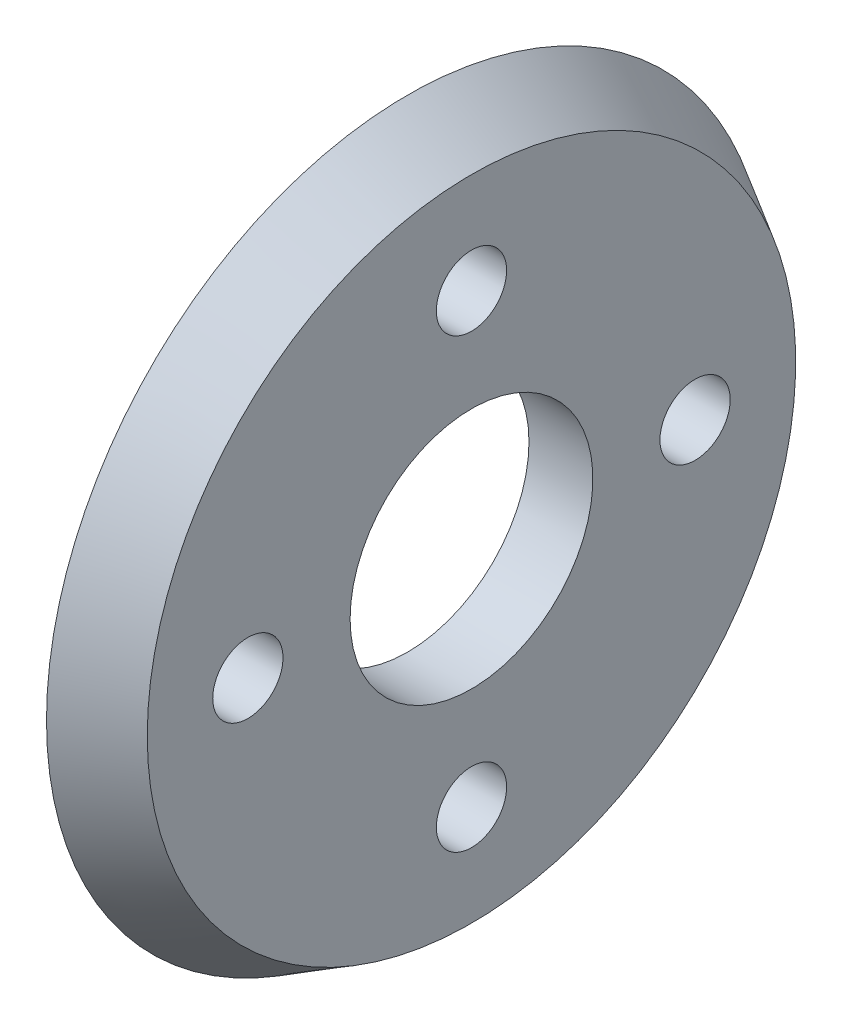
ISO-10303-21;
HEADER;
FILE_DESCRIPTION(('STEP AP214'),'2;1');
FILE_NAME('part.step','',(''),(''),'','','');
FILE_SCHEMA(('AUTOMOTIVE_DESIGN { 1 0 10303 214 1 1 1 1 }'));
ENDSEC;
DATA;
#1=APPLICATION_CONTEXT('core data for automotive mechanical design processes');
#2=APPLICATION_PROTOCOL_DEFINITION('international standard','automotive_design',2000,#1);
#3=PRODUCT_CONTEXT('',#1,'mechanical');
#4=PRODUCT('Part','Part','',(#3));
#5=PRODUCT_RELATED_PRODUCT_CATEGORY('part','',(#4));
#6=PRODUCT_DEFINITION_FORMATION('','',#4);
#7=PRODUCT_DEFINITION_CONTEXT('part definition',#1,'design');
#8=PRODUCT_DEFINITION('design','',#6,#7);
#9=PRODUCT_DEFINITION_SHAPE('','',#8);
#10=(LENGTH_UNIT() NAMED_UNIT(*) SI_UNIT(.MILLI.,.METRE.));
#11=(NAMED_UNIT(*) PLANE_ANGLE_UNIT() SI_UNIT($,.RADIAN.));
#12=(NAMED_UNIT(*) SI_UNIT($,.STERADIAN.) SOLID_ANGLE_UNIT());
#13=UNCERTAINTY_MEASURE_WITH_UNIT(LENGTH_MEASURE(1.E-05),#10,'distance_accuracy_value','');
#14=(GEOMETRIC_REPRESENTATION_CONTEXT(3) GLOBAL_UNCERTAINTY_ASSIGNED_CONTEXT((#13)) GLOBAL_UNIT_ASSIGNED_CONTEXT((#10,
#11,#12)) REPRESENTATION_CONTEXT('',''));
#15=CARTESIAN_POINT('',(0.,0.,0.));
#16=DIRECTION('',(0.,0.,1.));
#17=DIRECTION('',(1.,0.,0.));
#18=AXIS2_PLACEMENT_3D('',#15,#16,#17);
#19=CARTESIAN_POINT('',(-23.,0.,0.));
#20=DIRECTION('',(1.,0.,0.));
#21=DIRECTION('',(0.,0.,-1.));
#22=AXIS2_PLACEMENT_3D('',#19,#20,#21);
#23=PLANE('',#22);
#24=CARTESIAN_POINT('',(-23.,-7.,0.));
#25=DIRECTION('',(1.,0.,0.));
#26=DIRECTION('',(0.,0.,-1.));
#27=AXIS2_PLACEMENT_3D('',#24,#25,#26);
#28=CIRCLE('',#27,1.1);
#29=CARTESIAN_POINT('',(-23.,-7.,-1.1));
#30=VERTEX_POINT('',#29);
#31=EDGE_CURVE('E147',#30,#30,#28,.T.);
#32=ORIENTED_EDGE('',*,*,#31,.T.);
#33=EDGE_LOOP('',(#32));
#34=FACE_BOUND('',#33,.T.);
#35=CARTESIAN_POINT('',(-23.,0.,0.));
#36=DIRECTION('',(1.,0.,0.));
#37=DIRECTION('',(0.,0.,-1.));
#38=AXIS2_PLACEMENT_3D('',#35,#36,#37);
#39=CIRCLE('',#38,3.8);
#40=CARTESIAN_POINT('',(-23.,0.,-3.8));
#41=VERTEX_POINT('',#40);
#42=EDGE_CURVE('E145',#41,#41,#39,.T.);
#43=ORIENTED_EDGE('',*,*,#42,.T.);
#44=EDGE_LOOP('',(#43));
#45=FACE_BOUND('',#44,.T.);
#46=CARTESIAN_POINT('',(-23.,7.,0.));
#47=DIRECTION('',(1.,0.,0.));
#48=DIRECTION('',(0.,0.,-1.));
#49=AXIS2_PLACEMENT_3D('',#46,#47,#48);
#50=CIRCLE('',#49,1.1);
#51=CARTESIAN_POINT('',(-23.,7.,-1.1));
#52=VERTEX_POINT('',#51);
#53=EDGE_CURVE('E137',#52,#52,#50,.T.);
#54=ORIENTED_EDGE('',*,*,#53,.T.);
#55=EDGE_LOOP('',(#54));
#56=FACE_BOUND('',#55,.T.);
#57=CARTESIAN_POINT('',(-23.,0.,7.));
#58=DIRECTION('',(1.,0.,0.));
#59=DIRECTION('',(0.,0.,-1.));
#60=AXIS2_PLACEMENT_3D('',#57,#58,#59);
#61=CIRCLE('',#60,1.1);
#62=CARTESIAN_POINT('',(-23.,0.,5.9));
#63=VERTEX_POINT('',#62);
#64=EDGE_CURVE('E132',#63,#63,#61,.T.);
#65=ORIENTED_EDGE('',*,*,#64,.T.);
#66=EDGE_LOOP('',(#65));
#67=FACE_BOUND('',#66,.T.);
#68=CARTESIAN_POINT('',(-23.,0.,-7.));
#69=DIRECTION('',(1.,0.,0.));
#70=DIRECTION('',(0.,0.,-1.));
#71=AXIS2_PLACEMENT_3D('',#68,#69,#70);
#72=CIRCLE('',#71,1.1);
#73=CARTESIAN_POINT('',(-23.,0.,-8.1));
#74=VERTEX_POINT('',#73);
#75=EDGE_CURVE('E13',#74,#74,#72,.T.);
#76=ORIENTED_EDGE('',*,*,#75,.T.);
#77=EDGE_LOOP('',(#76));
#78=FACE_BOUND('',#77,.T.);
#79=CARTESIAN_POINT('',(-23.,0.,0.));
#80=DIRECTION('',(-1.,0.,0.));
#81=DIRECTION('',(0.,0.,1.));
#82=AXIS2_PLACEMENT_3D('',#79,#80,#81);
#83=CIRCLE('',#82,11.3047005383792);
#84=CARTESIAN_POINT('',(-23.,0.,11.3047005383792));
#85=VERTEX_POINT('',#84);
#86=EDGE_CURVE('E168',#85,#85,#83,.T.);
#87=ORIENTED_EDGE('',*,*,#86,.T.);
#88=EDGE_LOOP('',(#87));
#89=FACE_BOUND('',#88,.T.);
#90=ADVANCED_FACE('F124',(#34,#45,#56,#67,#78,#89),#23,.F.);
#91=CARTESIAN_POINT('',(23.,0.,7.));
#92=DIRECTION('',(-1.,0.,0.));
#93=DIRECTION('',(0.,0.,1.));
#94=AXIS2_PLACEMENT_3D('',#91,#92,#93);
#95=CYLINDRICAL_SURFACE('',#94,1.1);
#96=CARTESIAN_POINT('',(-21.,0.,7.));
#97=DIRECTION('',(-1.,0.,0.));
#98=DIRECTION('',(0.,0.,1.));
#99=AXIS2_PLACEMENT_3D('',#96,#97,#98);
#100=CIRCLE('',#99,1.1);
#101=CARTESIAN_POINT('',(-21.,0.,8.1));
#102=VERTEX_POINT('',#101);
#103=EDGE_CURVE('E140',#102,#102,#100,.T.);
#104=ORIENTED_EDGE('',*,*,#103,.F.);
#105=EDGE_LOOP('',(#104));
#106=FACE_BOUND('',#105,.T.);
#107=ORIENTED_EDGE('',*,*,#64,.F.);
#108=EDGE_LOOP('',(#107));
#109=FACE_BOUND('',#108,.T.);
#110=ADVANCED_FACE('F186',(#106,#109),#95,.F.);
#111=CARTESIAN_POINT('',(23.,7.,0.));
#112=DIRECTION('',(-1.,0.,0.));
#113=DIRECTION('',(0.,0.,1.));
#114=AXIS2_PLACEMENT_3D('',#111,#112,#113);
#115=CYLINDRICAL_SURFACE('',#114,1.1);
#116=CARTESIAN_POINT('',(-21.,7.,0.));
#117=DIRECTION('',(-1.,0.,0.));
#118=DIRECTION('',(0.,0.,1.));
#119=AXIS2_PLACEMENT_3D('',#116,#117,#118);
#120=CIRCLE('',#119,1.1);
#121=CARTESIAN_POINT('',(-21.,7.,1.1));
#122=VERTEX_POINT('',#121);
#123=EDGE_CURVE('E152',#122,#122,#120,.T.);
#124=ORIENTED_EDGE('',*,*,#123,.F.);
#125=EDGE_LOOP('',(#124));
#126=FACE_BOUND('',#125,.T.);
#127=ORIENTED_EDGE('',*,*,#53,.F.);
#128=EDGE_LOOP('',(#127));
#129=FACE_BOUND('',#128,.T.);
#130=ADVANCED_FACE('F191',(#126,#129),#115,.F.);
#131=CARTESIAN_POINT('',(23.,0.,0.));
#132=DIRECTION('',(-1.,0.,0.));
#133=DIRECTION('',(0.,0.,1.));
#134=AXIS2_PLACEMENT_3D('',#131,#132,#133);
#135=CYLINDRICAL_SURFACE('',#134,3.8);
#136=CARTESIAN_POINT('',(-21.,0.,0.));
#137=DIRECTION('',(-1.,0.,0.));
#138=DIRECTION('',(0.,0.,1.));
#139=AXIS2_PLACEMENT_3D('',#136,#137,#138);
#140=CIRCLE('',#139,3.8);
#141=CARTESIAN_POINT('',(-21.,0.,3.8));
#142=VERTEX_POINT('',#141);
#143=EDGE_CURVE('E156',#142,#142,#140,.T.);
#144=ORIENTED_EDGE('',*,*,#143,.F.);
#145=EDGE_LOOP('',(#144));
#146=FACE_BOUND('',#145,.T.);
#147=ORIENTED_EDGE('',*,*,#42,.F.);
#148=EDGE_LOOP('',(#147));
#149=FACE_BOUND('',#148,.T.);
#150=ADVANCED_FACE('F200',(#146,#149),#135,.F.);
#151=CARTESIAN_POINT('',(23.,-7.,0.));
#152=DIRECTION('',(-1.,0.,0.));
#153=DIRECTION('',(0.,0.,1.));
#154=AXIS2_PLACEMENT_3D('',#151,#152,#153);
#155=CYLINDRICAL_SURFACE('',#154,1.1);
#156=CARTESIAN_POINT('',(-21.,-7.,0.));
#157=DIRECTION('',(-1.,0.,0.));
#158=DIRECTION('',(0.,0.,1.));
#159=AXIS2_PLACEMENT_3D('',#156,#157,#158);
#160=CIRCLE('',#159,1.1);
#161=CARTESIAN_POINT('',(-21.,-7.,1.1));
#162=VERTEX_POINT('',#161);
#163=EDGE_CURVE('E160',#162,#162,#160,.T.);
#164=ORIENTED_EDGE('',*,*,#163,.F.);
#165=EDGE_LOOP('',(#164));
#166=FACE_BOUND('',#165,.T.);
#167=ORIENTED_EDGE('',*,*,#31,.F.);
#168=EDGE_LOOP('',(#167));
#169=FACE_BOUND('',#168,.T.);
#170=ADVANCED_FACE('F126',(#166,#169),#155,.F.);
#171=CARTESIAN_POINT('',(23.,0.,-7.));
#172=DIRECTION('',(-1.,0.,0.));
#173=DIRECTION('',(0.,0.,1.));
#174=AXIS2_PLACEMENT_3D('',#171,#172,#173);
#175=CYLINDRICAL_SURFACE('',#174,1.1);
#176=CARTESIAN_POINT('',(-21.,0.,-7.));
#177=DIRECTION('',(-1.,0.,0.));
#178=DIRECTION('',(0.,0.,1.));
#179=AXIS2_PLACEMENT_3D('',#176,#177,#178);
#180=CIRCLE('',#179,1.1);
#181=CARTESIAN_POINT('',(-21.,0.,-5.9));
#182=VERTEX_POINT('',#181);
#183=EDGE_CURVE('E128',#182,#182,#180,.T.);
#184=ORIENTED_EDGE('',*,*,#183,.F.);
#185=EDGE_LOOP('',(#184));
#186=FACE_BOUND('',#185,.T.);
#187=ORIENTED_EDGE('',*,*,#75,.F.);
#188=EDGE_LOOP('',(#187));
#189=FACE_BOUND('',#188,.T.);
#190=ADVANCED_FACE('F177',(#186,#189),#175,.F.);
#191=CARTESIAN_POINT('',(-21.,0.,0.));
#192=DIRECTION('',(-1.,0.,0.));
#193=DIRECTION('',(0.,0.,1.));
#194=AXIS2_PLACEMENT_3D('',#191,#192,#193);
#195=CONICAL_SURFACE('',#194,10.15,0.523598775598297);
#196=ORIENTED_EDGE('',*,*,#86,.F.);
#197=EDGE_LOOP('',(#196));
#198=FACE_BOUND('',#197,.T.);
#199=CARTESIAN_POINT('',(-21.,0.,0.));
#200=DIRECTION('',(-1.,0.,0.));
#201=DIRECTION('',(0.,0.,1.));
#202=AXIS2_PLACEMENT_3D('',#199,#200,#201);
#203=CIRCLE('',#202,10.15);
#204=CARTESIAN_POINT('',(-21.,0.,10.15));
#205=VERTEX_POINT('',#204);
#206=EDGE_CURVE('E165',#205,#205,#203,.T.);
#207=ORIENTED_EDGE('',*,*,#206,.T.);
#208=EDGE_LOOP('',(#207));
#209=FACE_BOUND('',#208,.T.);
#210=ADVANCED_FACE('F173',(#198,#209),#195,.T.);
#211=CARTESIAN_POINT('',(-21.,0.,0.));
#212=DIRECTION('',(-1.,0.,0.));
#213=DIRECTION('',(0.,0.,1.));
#214=AXIS2_PLACEMENT_3D('',#211,#212,#213);
#215=PLANE('',#214);
#216=ORIENTED_EDGE('',*,*,#103,.T.);
#217=EDGE_LOOP('',(#216));
#218=FACE_BOUND('',#217,.T.);
#219=ORIENTED_EDGE('',*,*,#123,.T.);
#220=EDGE_LOOP('',(#219));
#221=FACE_BOUND('',#220,.T.);
#222=ORIENTED_EDGE('',*,*,#143,.T.);
#223=EDGE_LOOP('',(#222));
#224=FACE_BOUND('',#223,.T.);
#225=ORIENTED_EDGE('',*,*,#163,.T.);
#226=EDGE_LOOP('',(#225));
#227=FACE_BOUND('',#226,.T.);
#228=ORIENTED_EDGE('',*,*,#183,.T.);
#229=EDGE_LOOP('',(#228));
#230=FACE_BOUND('',#229,.T.);
#231=ORIENTED_EDGE('',*,*,#206,.F.);
#232=EDGE_LOOP('',(#231));
#233=FACE_BOUND('',#232,.T.);
#234=ADVANCED_FACE('F176',(#218,#221,#224,#227,#230,#233),#215,.F.);
#235=CLOSED_SHELL('',(#90,#110,#130,#150,#170,#190,#210,#234));
#236=MANIFOLD_SOLID_BREP('B2',#235);
#237=ADVANCED_BREP_SHAPE_REPRESENTATION('',(#18,#236),#14);
#238=SHAPE_DEFINITION_REPRESENTATION(#9,#237);
ENDSEC;
END-ISO-10303-21;
